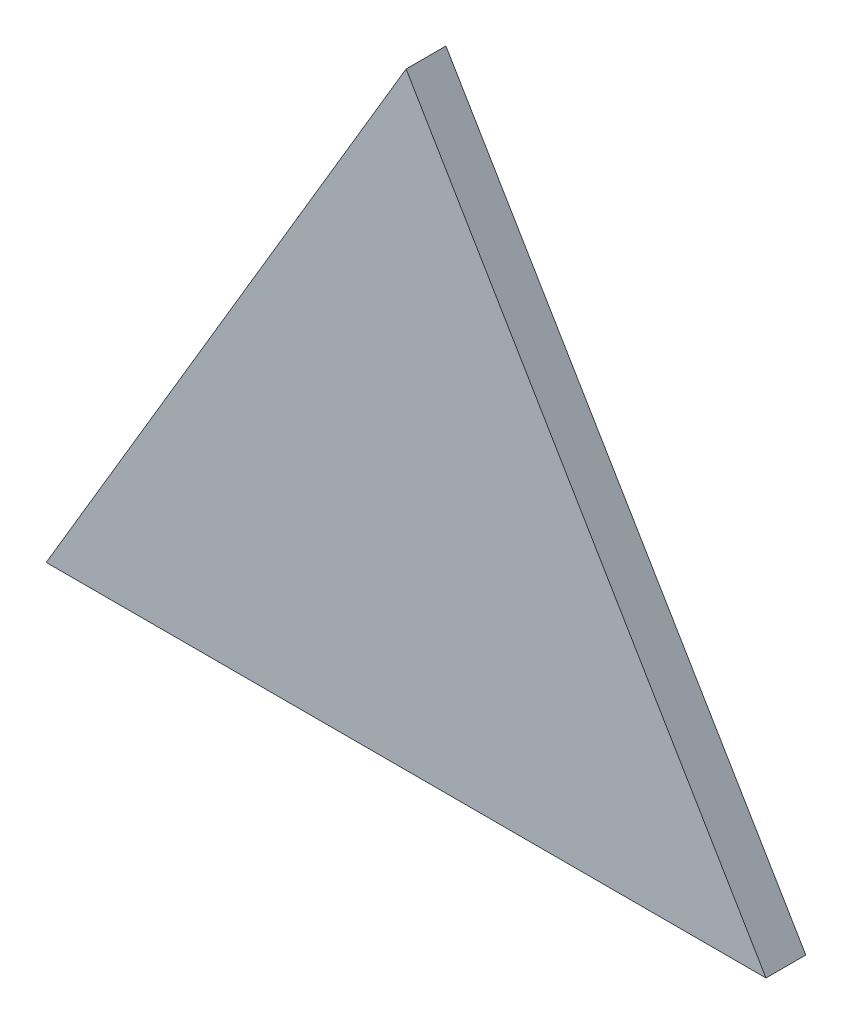
ISO-10303-21;
HEADER;
FILE_DESCRIPTION(('STEP AP214'),'2;1');
FILE_NAME('part.step','',(''),(''),'','','');
FILE_SCHEMA(('AUTOMOTIVE_DESIGN { 1 0 10303 214 1 1 1 1 }'));
ENDSEC;
DATA;
#1=APPLICATION_CONTEXT('core data for automotive mechanical design processes');
#2=APPLICATION_PROTOCOL_DEFINITION('international standard','automotive_design',2000,#1);
#3=PRODUCT_CONTEXT('',#1,'mechanical');
#4=PRODUCT('Part','Part','',(#3));
#5=PRODUCT_RELATED_PRODUCT_CATEGORY('part','',(#4));
#6=PRODUCT_DEFINITION_FORMATION('','',#4);
#7=PRODUCT_DEFINITION_CONTEXT('part definition',#1,'design');
#8=PRODUCT_DEFINITION('design','',#6,#7);
#9=PRODUCT_DEFINITION_SHAPE('','',#8);
#10=(LENGTH_UNIT() NAMED_UNIT(*) SI_UNIT(.MILLI.,.METRE.));
#11=(NAMED_UNIT(*) PLANE_ANGLE_UNIT() SI_UNIT($,.RADIAN.));
#12=(NAMED_UNIT(*) SI_UNIT($,.STERADIAN.) SOLID_ANGLE_UNIT());
#13=UNCERTAINTY_MEASURE_WITH_UNIT(LENGTH_MEASURE(1.E-05),#10,'distance_accuracy_value','');
#14=(GEOMETRIC_REPRESENTATION_CONTEXT(3) GLOBAL_UNCERTAINTY_ASSIGNED_CONTEXT((#13)) GLOBAL_UNIT_ASSIGNED_CONTEXT((#10,
#11,#12)) REPRESENTATION_CONTEXT('',''));
#15=CARTESIAN_POINT('',(0.,0.,0.));
#16=DIRECTION('',(0.,0.,1.));
#17=DIRECTION('',(1.,0.,0.));
#18=AXIS2_PLACEMENT_3D('',#15,#16,#17);
#19=CARTESIAN_POINT('',(-12.3042138671329,-1.03740541843096,-11.6112275560423));
#20=DIRECTION('',(0.,0.,1.));
#21=DIRECTION('',(0.,-1.,0.));
#22=AXIS2_PLACEMENT_3D('',#19,#20,#21);
#23=PLANE('',#22);
#24=DIRECTION('',(-0.509817411453408,-0.860282632033767,0.));
#25=VECTOR('',#24,1.);
#26=CARTESIAN_POINT('',(12.1096586367856,-2.68282273493069,-11.6112275560423));
#27=LINE('',#26,#25);
#28=CARTESIAN_POINT('',(11.6394732896332,-3.47622892095895,-11.6112275560423));
#29=VERTEX_POINT('',#28);
#30=CARTESIAN_POINT('',(12.1096586367856,-2.68282273493069,-11.6112275560423));
#31=VERTEX_POINT('',#30);
#32=EDGE_CURVE('E59',#29,#31,#27,.F.);
#33=ORIENTED_EDGE('',*,*,#32,.F.);
#34=DIRECTION('',(1.,0.,0.));
#35=VECTOR('',#34,1.);
#36=CARTESIAN_POINT('',(12.5798439839381,-3.47622892095895,-11.6112275560423));
#37=LINE('',#36,#35);
#38=CARTESIAN_POINT('',(12.5798439839381,-3.47622892095894,-11.6112275560423));
#39=VERTEX_POINT('',#38);
#40=EDGE_CURVE('E19',#39,#29,#37,.F.);
#41=ORIENTED_EDGE('',*,*,#40,.F.);
#42=DIRECTION('',(-0.50981741145342,0.860282632033761,0.));
#43=VECTOR('',#42,1.);
#44=CARTESIAN_POINT('',(12.1096586367856,-2.68282273493069,-11.6112275560423));
#45=LINE('',#44,#43);
#46=EDGE_CURVE('E52',#31,#39,#45,.F.);
#47=ORIENTED_EDGE('',*,*,#46,.F.);
#48=EDGE_LOOP('',(#33,#41,#47));
#49=FACE_BOUND('',#48,.T.);
#50=ADVANCED_FACE('F16',(#49),#23,.T.);
#51=CARTESIAN_POINT('',(12.5798439839381,-3.47622892095895,-11.6112275560423));
#52=DIRECTION('',(0.,-1.,0.));
#53=DIRECTION('',(1.,0.,0.));
#54=AXIS2_PLACEMENT_3D('',#51,#52,#53);
#55=PLANE('',#54);
#56=ORIENTED_EDGE('',*,*,#40,.T.);
#57=DIRECTION('',(0.,0.,1.));
#58=VECTOR('',#57,1.);
#59=CARTESIAN_POINT('',(11.6394732896332,-3.47622892095894,-11.6112275560423));
#60=LINE('',#59,#58);
#61=CARTESIAN_POINT('',(11.6394732896332,-3.47622892095895,-11.6632275560423));
#62=VERTEX_POINT('',#61);
#63=EDGE_CURVE('E63',#62,#29,#60,.T.);
#64=ORIENTED_EDGE('',*,*,#63,.F.);
#65=DIRECTION('',(1.,0.,0.));
#66=VECTOR('',#65,1.);
#67=CARTESIAN_POINT('',(-12.3042138671329,-3.47622892095895,-11.6632275560423));
#68=LINE('',#67,#66);
#69=CARTESIAN_POINT('',(12.5798439839381,-3.47622892095894,-11.6632275560423));
#70=VERTEX_POINT('',#69);
#71=EDGE_CURVE('E62',#62,#70,#68,.T.);
#72=ORIENTED_EDGE('',*,*,#71,.T.);
#73=DIRECTION('',(0.,0.,1.));
#74=VECTOR('',#73,1.);
#75=CARTESIAN_POINT('',(12.5798439839381,-3.47622892095894,-11.6112275560423));
#76=LINE('',#75,#74);
#77=EDGE_CURVE('E55',#39,#70,#76,.F.);
#78=ORIENTED_EDGE('',*,*,#77,.F.);
#79=EDGE_LOOP('',(#56,#64,#72,#78));
#80=FACE_BOUND('',#79,.T.);
#81=ADVANCED_FACE('F61',(#80),#55,.T.);
#82=CARTESIAN_POINT('',(12.1096586367856,-2.68282273493069,-11.6112275560423));
#83=DIRECTION('',(0.860282632033761,0.50981741145342,0.));
#84=DIRECTION('',(-0.50981741145342,0.860282632033761,0.));
#85=AXIS2_PLACEMENT_3D('',#82,#83,#84);
#86=PLANE('',#85);
#87=ORIENTED_EDGE('',*,*,#46,.T.);
#88=ORIENTED_EDGE('',*,*,#77,.T.);
#89=DIRECTION('',(-0.509817411453428,0.860282632033756,0.));
#90=VECTOR('',#89,1.);
#91=CARTESIAN_POINT('',(12.5798439839381,-3.47622892095895,-11.6632275560423));
#92=LINE('',#91,#90);
#93=CARTESIAN_POINT('',(12.1096586367856,-2.68282273493069,-11.6632275560423));
#94=VERTEX_POINT('',#93);
#95=EDGE_CURVE('E25',#70,#94,#92,.T.);
#96=ORIENTED_EDGE('',*,*,#95,.T.);
#97=DIRECTION('',(0.,0.,1.));
#98=VECTOR('',#97,1.);
#99=CARTESIAN_POINT('',(12.1096586367856,-2.68282273493068,-11.6112275560423));
#100=LINE('',#99,#98);
#101=EDGE_CURVE('E33',#31,#94,#100,.F.);
#102=ORIENTED_EDGE('',*,*,#101,.F.);
#103=EDGE_LOOP('',(#87,#88,#96,#102));
#104=FACE_BOUND('',#103,.T.);
#105=ADVANCED_FACE('F53',(#104),#86,.T.);
#106=CARTESIAN_POINT('',(12.1096586367856,-2.68282273493069,-11.6112275560423));
#107=DIRECTION('',(-0.860282632033767,0.509817411453408,0.));
#108=DIRECTION('',(-0.509817411453408,-0.860282632033767,0.));
#109=AXIS2_PLACEMENT_3D('',#106,#107,#108);
#110=PLANE('',#109);
#111=ORIENTED_EDGE('',*,*,#32,.T.);
#112=ORIENTED_EDGE('',*,*,#101,.T.);
#113=DIRECTION('',(-0.509817411453409,-0.860282632033767,0.));
#114=VECTOR('',#113,1.);
#115=CARTESIAN_POINT('',(12.1096586367856,-2.68282273493069,-11.6632275560423));
#116=LINE('',#115,#114);
#117=EDGE_CURVE('E11',#94,#62,#116,.T.);
#118=ORIENTED_EDGE('',*,*,#117,.T.);
#119=ORIENTED_EDGE('',*,*,#63,.T.);
#120=EDGE_LOOP('',(#111,#112,#118,#119));
#121=FACE_BOUND('',#120,.T.);
#122=ADVANCED_FACE('F72',(#121),#110,.T.);
#123=CARTESIAN_POINT('',(-12.3042138671329,-1.03740541843096,-11.6632275560423));
#124=DIRECTION('',(0.,0.,1.));
#125=DIRECTION('',(0.,-1.,0.));
#126=AXIS2_PLACEMENT_3D('',#123,#124,#125);
#127=PLANE('',#126);
#128=ORIENTED_EDGE('',*,*,#95,.F.);
#129=ORIENTED_EDGE('',*,*,#71,.F.);
#130=ORIENTED_EDGE('',*,*,#117,.F.);
#131=EDGE_LOOP('',(#128,#129,#130));
#132=FACE_BOUND('',#131,.T.);
#133=ADVANCED_FACE('F71',(#132),#127,.F.);
#134=CLOSED_SHELL('',(#50,#81,#105,#122,#133));
#135=MANIFOLD_SOLID_BREP('B1',#134);
#136=ADVANCED_BREP_SHAPE_REPRESENTATION('',(#18,#135),#14);
#137=SHAPE_DEFINITION_REPRESENTATION(#9,#136);
ENDSEC;
END-ISO-10303-21;
